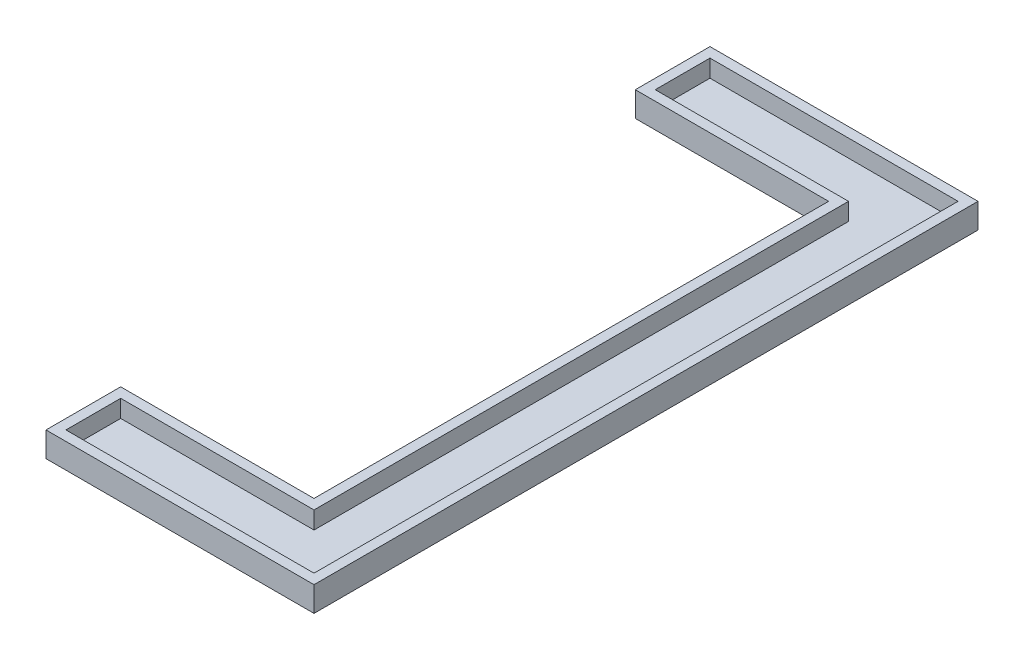
ISO-10303-21;
HEADER;
FILE_DESCRIPTION(('STEP AP214'),'2;1');
FILE_NAME('part.step','',(''),(''),'','','');
FILE_SCHEMA(('AUTOMOTIVE_DESIGN { 1 0 10303 214 1 1 1 1 }'));
ENDSEC;
DATA;
#1=APPLICATION_CONTEXT('core data for automotive mechanical design processes');
#2=APPLICATION_PROTOCOL_DEFINITION('international standard','automotive_design',2000,#1);
#3=PRODUCT_CONTEXT('',#1,'mechanical');
#4=PRODUCT('Part','Part','',(#3));
#5=PRODUCT_RELATED_PRODUCT_CATEGORY('part','',(#4));
#6=PRODUCT_DEFINITION_FORMATION('','',#4);
#7=PRODUCT_DEFINITION_CONTEXT('part definition',#1,'design');
#8=PRODUCT_DEFINITION('design','',#6,#7);
#9=PRODUCT_DEFINITION_SHAPE('','',#8);
#10=(LENGTH_UNIT() NAMED_UNIT(*) SI_UNIT(.MILLI.,.METRE.));
#11=(NAMED_UNIT(*) PLANE_ANGLE_UNIT() SI_UNIT($,.RADIAN.));
#12=(NAMED_UNIT(*) SI_UNIT($,.STERADIAN.) SOLID_ANGLE_UNIT());
#13=UNCERTAINTY_MEASURE_WITH_UNIT(LENGTH_MEASURE(1.E-05),#10,'distance_accuracy_value','');
#14=(GEOMETRIC_REPRESENTATION_CONTEXT(3) GLOBAL_UNCERTAINTY_ASSIGNED_CONTEXT((#13)) GLOBAL_UNIT_ASSIGNED_CONTEXT((#10,
#11,#12)) REPRESENTATION_CONTEXT('',''));
#15=CARTESIAN_POINT('',(0.,0.,0.));
#16=DIRECTION('',(0.,0.,1.));
#17=DIRECTION('',(1.,0.,0.));
#18=AXIS2_PLACEMENT_3D('',#15,#16,#17);
#19=CARTESIAN_POINT('',(0.,4.,-106.68));
#20=DIRECTION('',(1.,0.,0.));
#21=DIRECTION('',(0.,0.,-1.));
#22=AXIS2_PLACEMENT_3D('',#19,#20,#21);
#23=PLANE('',#22);
#24=DIRECTION('',(0.,0.,1.));
#25=VECTOR('',#24,1.);
#26=CARTESIAN_POINT('',(0.,0.,-106.68));
#27=LINE('',#26,#25);
#28=CARTESIAN_POINT('',(0.,0.,-106.68));
#29=VERTEX_POINT('',#28);
#30=CARTESIAN_POINT('',(0.,0.,-94.6800000000001));
#31=VERTEX_POINT('',#30);
#32=EDGE_CURVE('E142',#29,#31,#27,.T.);
#33=ORIENTED_EDGE('',*,*,#32,.T.);
#34=DIRECTION('',(0.,-1.,0.));
#35=VECTOR('',#34,1.);
#36=CARTESIAN_POINT('',(0.,4.,-94.6800000000001));
#37=LINE('',#36,#35);
#38=CARTESIAN_POINT('',(0.,4.,-94.6800000000001));
#39=VERTEX_POINT('',#38);
#40=EDGE_CURVE('E11',#39,#31,#37,.T.);
#41=ORIENTED_EDGE('',*,*,#40,.F.);
#42=DIRECTION('',(0.,0.,1.));
#43=VECTOR('',#42,1.);
#44=CARTESIAN_POINT('',(0.,4.,-106.68));
#45=LINE('',#44,#43);
#46=CARTESIAN_POINT('',(0.,4.,-106.68));
#47=VERTEX_POINT('',#46);
#48=EDGE_CURVE('E158',#47,#39,#45,.T.);
#49=ORIENTED_EDGE('',*,*,#48,.F.);
#50=DIRECTION('',(0.,-1.,0.));
#51=VECTOR('',#50,1.);
#52=CARTESIAN_POINT('',(0.,4.,-106.68));
#53=LINE('',#52,#51);
#54=EDGE_CURVE('E138',#47,#29,#53,.T.);
#55=ORIENTED_EDGE('',*,*,#54,.T.);
#56=EDGE_LOOP('',(#33,#41,#49,#55));
#57=FACE_BOUND('',#56,.T.);
#58=ADVANCED_FACE('F34',(#57),#23,.F.);
#59=CARTESIAN_POINT('',(0.,4.,-94.6800000000001));
#60=DIRECTION('',(0.,0.,-1.));
#61=DIRECTION('',(-1.,0.,0.));
#62=AXIS2_PLACEMENT_3D('',#59,#60,#61);
#63=PLANE('',#62);
#64=DIRECTION('',(1.,0.,0.));
#65=VECTOR('',#64,1.);
#66=CARTESIAN_POINT('',(0.,0.,-94.6800000000001));
#67=LINE('',#66,#65);
#68=CARTESIAN_POINT('',(31.06,0.,-94.6800000000001));
#69=VERTEX_POINT('',#68);
#70=EDGE_CURVE('E145',#31,#69,#67,.T.);
#71=ORIENTED_EDGE('',*,*,#70,.T.);
#72=DIRECTION('',(0.,-1.,0.));
#73=VECTOR('',#72,1.);
#74=CARTESIAN_POINT('',(31.06,4.,-94.6800000000001));
#75=LINE('',#74,#73);
#76=CARTESIAN_POINT('',(31.06,4.,-94.6800000000001));
#77=VERTEX_POINT('',#76);
#78=EDGE_CURVE('E41',#77,#69,#75,.T.);
#79=ORIENTED_EDGE('',*,*,#78,.F.);
#80=DIRECTION('',(1.,0.,0.));
#81=VECTOR('',#80,1.);
#82=CARTESIAN_POINT('',(0.,4.,-94.6800000000001));
#83=LINE('',#82,#81);
#84=EDGE_CURVE('E98',#39,#77,#83,.T.);
#85=ORIENTED_EDGE('',*,*,#84,.F.);
#86=ORIENTED_EDGE('',*,*,#40,.T.);
#87=EDGE_LOOP('',(#71,#79,#85,#86));
#88=FACE_BOUND('',#87,.T.);
#89=ADVANCED_FACE('F332',(#88),#63,.F.);
#90=CARTESIAN_POINT('',(31.06,4.,-94.6800000000001));
#91=DIRECTION('',(1.,0.,0.));
#92=DIRECTION('',(0.,0.,-1.));
#93=AXIS2_PLACEMENT_3D('',#90,#91,#92);
#94=PLANE('',#93);
#95=DIRECTION('',(0.,0.,1.));
#96=VECTOR('',#95,1.);
#97=CARTESIAN_POINT('',(31.06,0.,-94.6800000000001));
#98=LINE('',#97,#96);
#99=CARTESIAN_POINT('',(31.06,0.,-12.));
#100=VERTEX_POINT('',#99);
#101=EDGE_CURVE('E148',#69,#100,#98,.T.);
#102=ORIENTED_EDGE('',*,*,#101,.T.);
#103=DIRECTION('',(0.,-1.,0.));
#104=VECTOR('',#103,1.);
#105=CARTESIAN_POINT('',(31.06,4.,-12.));
#106=LINE('',#105,#104);
#107=CARTESIAN_POINT('',(31.06,4.,-12.));
#108=VERTEX_POINT('',#107);
#109=EDGE_CURVE('E165',#108,#100,#106,.T.);
#110=ORIENTED_EDGE('',*,*,#109,.F.);
#111=DIRECTION('',(0.,0.,1.));
#112=VECTOR('',#111,1.);
#113=CARTESIAN_POINT('',(31.06,4.,-94.6800000000001));
#114=LINE('',#113,#112);
#115=EDGE_CURVE('E173',#77,#108,#114,.T.);
#116=ORIENTED_EDGE('',*,*,#115,.F.);
#117=ORIENTED_EDGE('',*,*,#78,.T.);
#118=EDGE_LOOP('',(#102,#110,#116,#117));
#119=FACE_BOUND('',#118,.T.);
#120=ADVANCED_FACE('F171',(#119),#94,.F.);
#121=CARTESIAN_POINT('',(31.06,4.,-12.));
#122=DIRECTION('',(0.,0.,1.));
#123=DIRECTION('',(1.,0.,0.));
#124=AXIS2_PLACEMENT_3D('',#121,#122,#123);
#125=PLANE('',#124);
#126=DIRECTION('',(-1.,0.,0.));
#127=VECTOR('',#126,1.);
#128=CARTESIAN_POINT('',(31.06,0.,-12.));
#129=LINE('',#128,#127);
#130=CARTESIAN_POINT('',(0.,0.,-12.));
#131=VERTEX_POINT('',#130);
#132=EDGE_CURVE('E150',#100,#131,#129,.T.);
#133=ORIENTED_EDGE('',*,*,#132,.T.);
#134=DIRECTION('',(0.,-1.,0.));
#135=VECTOR('',#134,1.);
#136=CARTESIAN_POINT('',(0.,4.,-12.));
#137=LINE('',#136,#135);
#138=CARTESIAN_POINT('',(0.,4.,-12.));
#139=VERTEX_POINT('',#138);
#140=EDGE_CURVE('E162',#139,#131,#137,.T.);
#141=ORIENTED_EDGE('',*,*,#140,.F.);
#142=DIRECTION('',(-1.,0.,0.));
#143=VECTOR('',#142,1.);
#144=CARTESIAN_POINT('',(31.06,4.,-12.));
#145=LINE('',#144,#143);
#146=EDGE_CURVE('E185',#108,#139,#145,.T.);
#147=ORIENTED_EDGE('',*,*,#146,.F.);
#148=ORIENTED_EDGE('',*,*,#109,.T.);
#149=EDGE_LOOP('',(#133,#141,#147,#148));
#150=FACE_BOUND('',#149,.T.);
#151=ADVANCED_FACE('F181',(#150),#125,.F.);
#152=CARTESIAN_POINT('',(0.,4.,0.));
#153=DIRECTION('',(1.,0.,0.));
#154=DIRECTION('',(0.,0.,-1.));
#155=AXIS2_PLACEMENT_3D('',#152,#153,#154);
#156=PLANE('',#155);
#157=DIRECTION('',(0.,0.,1.));
#158=VECTOR('',#157,1.);
#159=CARTESIAN_POINT('',(0.,0.,0.));
#160=LINE('',#159,#158);
#161=CARTESIAN_POINT('',(0.,0.,0.));
#162=VERTEX_POINT('',#161);
#163=EDGE_CURVE('E152',#131,#162,#160,.T.);
#164=ORIENTED_EDGE('',*,*,#163,.T.);
#165=DIRECTION('',(0.,-1.,0.));
#166=VECTOR('',#165,1.);
#167=CARTESIAN_POINT('',(0.,4.,0.));
#168=LINE('',#167,#166);
#169=CARTESIAN_POINT('',(0.,4.,0.));
#170=VERTEX_POINT('',#169);
#171=EDGE_CURVE('E133',#170,#162,#168,.T.);
#172=ORIENTED_EDGE('',*,*,#171,.F.);
#173=DIRECTION('',(0.,0.,1.));
#174=VECTOR('',#173,1.);
#175=CARTESIAN_POINT('',(0.,4.,0.));
#176=LINE('',#175,#174);
#177=EDGE_CURVE('E121',#139,#170,#176,.T.);
#178=ORIENTED_EDGE('',*,*,#177,.F.);
#179=ORIENTED_EDGE('',*,*,#140,.T.);
#180=EDGE_LOOP('',(#164,#172,#178,#179));
#181=FACE_BOUND('',#180,.T.);
#182=ADVANCED_FACE('F184',(#181),#156,.F.);
#183=CARTESIAN_POINT('',(43.06,4.,0.));
#184=DIRECTION('',(0.,0.,-1.));
#185=DIRECTION('',(-1.,0.,0.));
#186=AXIS2_PLACEMENT_3D('',#183,#184,#185);
#187=PLANE('',#186);
#188=DIRECTION('',(1.,0.,0.));
#189=VECTOR('',#188,1.);
#190=CARTESIAN_POINT('',(43.06,0.,0.));
#191=LINE('',#190,#189);
#192=CARTESIAN_POINT('',(43.06,0.,0.));
#193=VERTEX_POINT('',#192);
#194=EDGE_CURVE('E130',#162,#193,#191,.T.);
#195=ORIENTED_EDGE('',*,*,#194,.T.);
#196=DIRECTION('',(0.,-1.,0.));
#197=VECTOR('',#196,1.);
#198=CARTESIAN_POINT('',(43.06,4.,0.));
#199=LINE('',#198,#197);
#200=CARTESIAN_POINT('',(43.06,4.,0.));
#201=VERTEX_POINT('',#200);
#202=EDGE_CURVE('E127',#201,#193,#199,.T.);
#203=ORIENTED_EDGE('',*,*,#202,.F.);
#204=DIRECTION('',(1.,0.,0.));
#205=VECTOR('',#204,1.);
#206=CARTESIAN_POINT('',(43.06,4.,0.));
#207=LINE('',#206,#205);
#208=EDGE_CURVE('E114',#170,#201,#207,.T.);
#209=ORIENTED_EDGE('',*,*,#208,.F.);
#210=ORIENTED_EDGE('',*,*,#171,.T.);
#211=EDGE_LOOP('',(#195,#203,#209,#210));
#212=FACE_BOUND('',#211,.T.);
#213=ADVANCED_FACE('F128',(#212),#187,.F.);
#214=CARTESIAN_POINT('',(43.06,4.,-106.68));
#215=DIRECTION('',(-1.,0.,0.));
#216=DIRECTION('',(0.,0.,1.));
#217=AXIS2_PLACEMENT_3D('',#214,#215,#216);
#218=PLANE('',#217);
#219=DIRECTION('',(0.,0.,-1.));
#220=VECTOR('',#219,1.);
#221=CARTESIAN_POINT('',(43.06,0.,-106.68));
#222=LINE('',#221,#220);
#223=CARTESIAN_POINT('',(43.06,0.,-106.68));
#224=VERTEX_POINT('',#223);
#225=EDGE_CURVE('E155',#193,#224,#222,.T.);
#226=ORIENTED_EDGE('',*,*,#225,.T.);
#227=DIRECTION('',(0.,-1.,0.));
#228=VECTOR('',#227,1.);
#229=CARTESIAN_POINT('',(43.06,4.,-106.68));
#230=LINE('',#229,#228);
#231=CARTESIAN_POINT('',(43.06,4.,-106.68));
#232=VERTEX_POINT('',#231);
#233=EDGE_CURVE('E134',#232,#224,#230,.T.);
#234=ORIENTED_EDGE('',*,*,#233,.F.);
#235=DIRECTION('',(0.,0.,-1.));
#236=VECTOR('',#235,1.);
#237=CARTESIAN_POINT('',(43.06,4.,-106.68));
#238=LINE('',#237,#236);
#239=EDGE_CURVE('E118',#201,#232,#238,.T.);
#240=ORIENTED_EDGE('',*,*,#239,.F.);
#241=ORIENTED_EDGE('',*,*,#202,.T.);
#242=EDGE_LOOP('',(#226,#234,#240,#241));
#243=FACE_BOUND('',#242,.T.);
#244=ADVANCED_FACE('F136',(#243),#218,.F.);
#245=CARTESIAN_POINT('',(0.,4.,-106.68));
#246=DIRECTION('',(0.,0.,1.));
#247=DIRECTION('',(1.,0.,0.));
#248=AXIS2_PLACEMENT_3D('',#245,#246,#247);
#249=PLANE('',#248);
#250=DIRECTION('',(-1.,0.,0.));
#251=VECTOR('',#250,1.);
#252=CARTESIAN_POINT('',(0.,0.,-106.68));
#253=LINE('',#252,#251);
#254=EDGE_CURVE('E90',#224,#29,#253,.T.);
#255=ORIENTED_EDGE('',*,*,#254,.T.);
#256=ORIENTED_EDGE('',*,*,#54,.F.);
#257=DIRECTION('',(-1.,0.,0.));
#258=VECTOR('',#257,1.);
#259=CARTESIAN_POINT('',(0.,4.,-106.68));
#260=LINE('',#259,#258);
#261=EDGE_CURVE('E57',#232,#47,#260,.T.);
#262=ORIENTED_EDGE('',*,*,#261,.F.);
#263=ORIENTED_EDGE('',*,*,#233,.T.);
#264=EDGE_LOOP('',(#255,#256,#262,#263));
#265=FACE_BOUND('',#264,.T.);
#266=ADVANCED_FACE('F339',(#265),#249,.F.);
#267=CARTESIAN_POINT('',(0.,4.,0.));
#268=DIRECTION('',(0.,1.,0.));
#269=DIRECTION('',(0.,0.,1.));
#270=AXIS2_PLACEMENT_3D('',#267,#268,#269);
#271=PLANE('',#270);
#272=DIRECTION('',(-1.,0.,0.));
#273=VECTOR('',#272,1.);
#274=CARTESIAN_POINT('',(41.46,4.,-105.08));
#275=LINE('',#274,#273);
#276=CARTESIAN_POINT('',(41.46,4.,-105.08));
#277=VERTEX_POINT('',#276);
#278=CARTESIAN_POINT('',(1.59999999999999,4.,-105.08));
#279=VERTEX_POINT('',#278);
#280=EDGE_CURVE('E48',#277,#279,#275,.T.);
#281=ORIENTED_EDGE('',*,*,#280,.F.);
#282=DIRECTION('',(0.,0.,-1.));
#283=VECTOR('',#282,1.);
#284=CARTESIAN_POINT('',(41.46,4.,-1.6));
#285=LINE('',#284,#283);
#286=CARTESIAN_POINT('',(41.46,4.,-1.6));
#287=VERTEX_POINT('',#286);
#288=EDGE_CURVE('E213',#287,#277,#285,.T.);
#289=ORIENTED_EDGE('',*,*,#288,.F.);
#290=DIRECTION('',(1.,0.,0.));
#291=VECTOR('',#290,1.);
#292=CARTESIAN_POINT('',(1.6,4.,-1.6));
#293=LINE('',#292,#291);
#294=CARTESIAN_POINT('',(1.6,4.,-1.6));
#295=VERTEX_POINT('',#294);
#296=EDGE_CURVE('E217',#295,#287,#293,.T.);
#297=ORIENTED_EDGE('',*,*,#296,.F.);
#298=DIRECTION('',(0.,0.,1.));
#299=VECTOR('',#298,1.);
#300=CARTESIAN_POINT('',(1.6,4.,-10.4));
#301=LINE('',#300,#299);
#302=CARTESIAN_POINT('',(1.6,4.,-10.4));
#303=VERTEX_POINT('',#302);
#304=EDGE_CURVE('E220',#303,#295,#301,.T.);
#305=ORIENTED_EDGE('',*,*,#304,.F.);
#306=DIRECTION('',(-1.,0.,0.));
#307=VECTOR('',#306,1.);
#308=CARTESIAN_POINT('',(32.66,4.,-10.4));
#309=LINE('',#308,#307);
#310=CARTESIAN_POINT('',(32.66,4.,-10.4));
#311=VERTEX_POINT('',#310);
#312=EDGE_CURVE('E223',#311,#303,#309,.T.);
#313=ORIENTED_EDGE('',*,*,#312,.F.);
#314=DIRECTION('',(0.,0.,1.));
#315=VECTOR('',#314,1.);
#316=CARTESIAN_POINT('',(32.66,4.,-96.2800000000001));
#317=LINE('',#316,#315);
#318=CARTESIAN_POINT('',(32.66,4.,-96.2800000000001));
#319=VERTEX_POINT('',#318);
#320=EDGE_CURVE('E226',#319,#311,#317,.T.);
#321=ORIENTED_EDGE('',*,*,#320,.F.);
#322=DIRECTION('',(1.,0.,0.));
#323=VECTOR('',#322,1.);
#324=CARTESIAN_POINT('',(1.59999999999999,4.,-96.2800000000001));
#325=LINE('',#324,#323);
#326=CARTESIAN_POINT('',(1.59999999999999,4.,-96.2800000000001));
#327=VERTEX_POINT('',#326);
#328=EDGE_CURVE('E229',#327,#319,#325,.T.);
#329=ORIENTED_EDGE('',*,*,#328,.F.);
#330=DIRECTION('',(0.,0.,1.));
#331=VECTOR('',#330,1.);
#332=CARTESIAN_POINT('',(1.59999999999999,4.,-105.08));
#333=LINE('',#332,#331);
#334=EDGE_CURVE('E232',#279,#327,#333,.T.);
#335=ORIENTED_EDGE('',*,*,#334,.F.);
#336=EDGE_LOOP('',(#281,#289,#297,#305,#313,#321,#329,#335));
#337=FACE_BOUND('',#336,.T.);
#338=ORIENTED_EDGE('',*,*,#48,.T.);
#339=ORIENTED_EDGE('',*,*,#84,.T.);
#340=ORIENTED_EDGE('',*,*,#115,.T.);
#341=ORIENTED_EDGE('',*,*,#146,.T.);
#342=ORIENTED_EDGE('',*,*,#177,.T.);
#343=ORIENTED_EDGE('',*,*,#208,.T.);
#344=ORIENTED_EDGE('',*,*,#239,.T.);
#345=ORIENTED_EDGE('',*,*,#261,.T.);
#346=EDGE_LOOP('',(#338,#339,#340,#341,#342,#343,#344,#345));
#347=FACE_BOUND('',#346,.T.);
#348=ADVANCED_FACE('F116',(#337,#347),#271,.T.);
#349=CARTESIAN_POINT('',(0.,0.,0.));
#350=DIRECTION('',(0.,1.,0.));
#351=DIRECTION('',(0.,0.,1.));
#352=AXIS2_PLACEMENT_3D('',#349,#350,#351);
#353=PLANE('',#352);
#354=ORIENTED_EDGE('',*,*,#32,.F.);
#355=ORIENTED_EDGE('',*,*,#254,.F.);
#356=ORIENTED_EDGE('',*,*,#225,.F.);
#357=ORIENTED_EDGE('',*,*,#194,.F.);
#358=ORIENTED_EDGE('',*,*,#163,.F.);
#359=ORIENTED_EDGE('',*,*,#132,.F.);
#360=ORIENTED_EDGE('',*,*,#101,.F.);
#361=ORIENTED_EDGE('',*,*,#70,.F.);
#362=EDGE_LOOP('',(#354,#355,#356,#357,#358,#359,#360,#361));
#363=FACE_BOUND('',#362,.T.);
#364=ADVANCED_FACE('F177',(#363),#353,.F.);
#365=CARTESIAN_POINT('',(41.46,1.2,-105.08));
#366=DIRECTION('',(0.,0.,-1.));
#367=DIRECTION('',(-1.,0.,0.));
#368=AXIS2_PLACEMENT_3D('',#365,#366,#367);
#369=PLANE('',#368);
#370=ORIENTED_EDGE('',*,*,#280,.T.);
#371=DIRECTION('',(0.,1.,0.));
#372=VECTOR('',#371,1.);
#373=CARTESIAN_POINT('',(1.59999999999999,1.2,-105.08));
#374=LINE('',#373,#372);
#375=CARTESIAN_POINT('',(1.59999999999999,1.2,-105.08));
#376=VERTEX_POINT('',#375);
#377=EDGE_CURVE('E191',#376,#279,#374,.T.);
#378=ORIENTED_EDGE('',*,*,#377,.F.);
#379=DIRECTION('',(-1.,0.,0.));
#380=VECTOR('',#379,1.);
#381=CARTESIAN_POINT('',(41.46,1.2,-105.08));
#382=LINE('',#381,#380);
#383=CARTESIAN_POINT('',(41.46,1.2,-105.08));
#384=VERTEX_POINT('',#383);
#385=EDGE_CURVE('E216',#384,#376,#382,.T.);
#386=ORIENTED_EDGE('',*,*,#385,.F.);
#387=DIRECTION('',(0.,1.,0.));
#388=VECTOR('',#387,1.);
#389=CARTESIAN_POINT('',(41.46,1.2,-105.08));
#390=LINE('',#389,#388);
#391=EDGE_CURVE('E146',#384,#277,#390,.T.);
#392=ORIENTED_EDGE('',*,*,#391,.T.);
#393=EDGE_LOOP('',(#370,#378,#386,#392));
#394=FACE_BOUND('',#393,.T.);
#395=ADVANCED_FACE('F265',(#394),#369,.F.);
#396=CARTESIAN_POINT('',(41.46,1.2,-1.6));
#397=DIRECTION('',(1.,0.,0.));
#398=DIRECTION('',(0.,0.,-1.));
#399=AXIS2_PLACEMENT_3D('',#396,#397,#398);
#400=PLANE('',#399);
#401=ORIENTED_EDGE('',*,*,#288,.T.);
#402=ORIENTED_EDGE('',*,*,#391,.F.);
#403=DIRECTION('',(0.,0.,-1.));
#404=VECTOR('',#403,1.);
#405=CARTESIAN_POINT('',(41.46,1.2,-1.6));
#406=LINE('',#405,#404);
#407=CARTESIAN_POINT('',(41.46,1.2,-1.6));
#408=VERTEX_POINT('',#407);
#409=EDGE_CURVE('E194',#408,#384,#406,.T.);
#410=ORIENTED_EDGE('',*,*,#409,.F.);
#411=DIRECTION('',(0.,1.,0.));
#412=VECTOR('',#411,1.);
#413=CARTESIAN_POINT('',(41.46,1.2,-1.6));
#414=LINE('',#413,#412);
#415=EDGE_CURVE('E209',#408,#287,#414,.T.);
#416=ORIENTED_EDGE('',*,*,#415,.T.);
#417=EDGE_LOOP('',(#401,#402,#410,#416));
#418=FACE_BOUND('',#417,.T.);
#419=ADVANCED_FACE('F285',(#418),#400,.F.);
#420=CARTESIAN_POINT('',(1.6,1.2,-1.6));
#421=DIRECTION('',(0.,0.,1.));
#422=DIRECTION('',(1.,0.,0.));
#423=AXIS2_PLACEMENT_3D('',#420,#421,#422);
#424=PLANE('',#423);
#425=ORIENTED_EDGE('',*,*,#296,.T.);
#426=ORIENTED_EDGE('',*,*,#415,.F.);
#427=DIRECTION('',(1.,0.,0.));
#428=VECTOR('',#427,1.);
#429=CARTESIAN_POINT('',(1.6,1.2,-1.6));
#430=LINE('',#429,#428);
#431=CARTESIAN_POINT('',(1.6,1.2,-1.6));
#432=VERTEX_POINT('',#431);
#433=EDGE_CURVE('E238',#432,#408,#430,.T.);
#434=ORIENTED_EDGE('',*,*,#433,.F.);
#435=DIRECTION('',(0.,1.,0.));
#436=VECTOR('',#435,1.);
#437=CARTESIAN_POINT('',(1.6,1.2,-1.6));
#438=LINE('',#437,#436);
#439=EDGE_CURVE('E206',#432,#295,#438,.T.);
#440=ORIENTED_EDGE('',*,*,#439,.T.);
#441=EDGE_LOOP('',(#425,#426,#434,#440));
#442=FACE_BOUND('',#441,.T.);
#443=ADVANCED_FACE('F290',(#442),#424,.F.);
#444=CARTESIAN_POINT('',(1.6,1.2,-10.4));
#445=DIRECTION('',(-1.,0.,0.));
#446=DIRECTION('',(0.,0.,1.));
#447=AXIS2_PLACEMENT_3D('',#444,#445,#446);
#448=PLANE('',#447);
#449=ORIENTED_EDGE('',*,*,#304,.T.);
#450=ORIENTED_EDGE('',*,*,#439,.F.);
#451=DIRECTION('',(0.,0.,1.));
#452=VECTOR('',#451,1.);
#453=CARTESIAN_POINT('',(1.6,1.2,-10.4));
#454=LINE('',#453,#452);
#455=CARTESIAN_POINT('',(1.6,1.2,-10.4));
#456=VERTEX_POINT('',#455);
#457=EDGE_CURVE('E241',#456,#432,#454,.T.);
#458=ORIENTED_EDGE('',*,*,#457,.F.);
#459=DIRECTION('',(0.,1.,0.));
#460=VECTOR('',#459,1.);
#461=CARTESIAN_POINT('',(1.6,1.2,-10.4));
#462=LINE('',#461,#460);
#463=EDGE_CURVE('E203',#456,#303,#462,.T.);
#464=ORIENTED_EDGE('',*,*,#463,.T.);
#465=EDGE_LOOP('',(#449,#450,#458,#464));
#466=FACE_BOUND('',#465,.T.);
#467=ADVANCED_FACE('F316',(#466),#448,.F.);
#468=CARTESIAN_POINT('',(32.66,1.2,-10.4));
#469=DIRECTION('',(0.,0.,-1.));
#470=DIRECTION('',(-1.,0.,0.));
#471=AXIS2_PLACEMENT_3D('',#468,#469,#470);
#472=PLANE('',#471);
#473=ORIENTED_EDGE('',*,*,#312,.T.);
#474=ORIENTED_EDGE('',*,*,#463,.F.);
#475=DIRECTION('',(-1.,0.,0.));
#476=VECTOR('',#475,1.);
#477=CARTESIAN_POINT('',(32.66,1.2,-10.4));
#478=LINE('',#477,#476);
#479=CARTESIAN_POINT('',(32.66,1.2,-10.4));
#480=VERTEX_POINT('',#479);
#481=EDGE_CURVE('E244',#480,#456,#478,.T.);
#482=ORIENTED_EDGE('',*,*,#481,.F.);
#483=DIRECTION('',(0.,1.,0.));
#484=VECTOR('',#483,1.);
#485=CARTESIAN_POINT('',(32.66,1.2,-10.4));
#486=LINE('',#485,#484);
#487=EDGE_CURVE('E200',#480,#311,#486,.T.);
#488=ORIENTED_EDGE('',*,*,#487,.T.);
#489=EDGE_LOOP('',(#473,#474,#482,#488));
#490=FACE_BOUND('',#489,.T.);
#491=ADVANCED_FACE('F319',(#490),#472,.F.);
#492=CARTESIAN_POINT('',(32.66,1.2,-96.2800000000001));
#493=DIRECTION('',(-1.,0.,0.));
#494=DIRECTION('',(0.,0.,1.));
#495=AXIS2_PLACEMENT_3D('',#492,#493,#494);
#496=PLANE('',#495);
#497=ORIENTED_EDGE('',*,*,#320,.T.);
#498=ORIENTED_EDGE('',*,*,#487,.F.);
#499=DIRECTION('',(0.,0.,1.));
#500=VECTOR('',#499,1.);
#501=CARTESIAN_POINT('',(32.66,1.2,-96.2800000000001));
#502=LINE('',#501,#500);
#503=CARTESIAN_POINT('',(32.66,1.2,-96.2800000000001));
#504=VERTEX_POINT('',#503);
#505=EDGE_CURVE('E247',#504,#480,#502,.T.);
#506=ORIENTED_EDGE('',*,*,#505,.F.);
#507=DIRECTION('',(0.,1.,0.));
#508=VECTOR('',#507,1.);
#509=CARTESIAN_POINT('',(32.66,1.2,-96.2800000000001));
#510=LINE('',#509,#508);
#511=EDGE_CURVE('E197',#504,#319,#510,.T.);
#512=ORIENTED_EDGE('',*,*,#511,.T.);
#513=EDGE_LOOP('',(#497,#498,#506,#512));
#514=FACE_BOUND('',#513,.T.);
#515=ADVANCED_FACE('F322',(#514),#496,.F.);
#516=CARTESIAN_POINT('',(1.59999999999999,1.2,-96.2800000000001));
#517=DIRECTION('',(0.,0.,1.));
#518=DIRECTION('',(1.,0.,0.));
#519=AXIS2_PLACEMENT_3D('',#516,#517,#518);
#520=PLANE('',#519);
#521=ORIENTED_EDGE('',*,*,#328,.T.);
#522=ORIENTED_EDGE('',*,*,#511,.F.);
#523=DIRECTION('',(1.,0.,0.));
#524=VECTOR('',#523,1.);
#525=CARTESIAN_POINT('',(1.59999999999999,1.2,-96.2800000000001));
#526=LINE('',#525,#524);
#527=CARTESIAN_POINT('',(1.59999999999999,1.2,-96.2800000000001));
#528=VERTEX_POINT('',#527);
#529=EDGE_CURVE('E250',#528,#504,#526,.T.);
#530=ORIENTED_EDGE('',*,*,#529,.F.);
#531=DIRECTION('',(0.,1.,0.));
#532=VECTOR('',#531,1.);
#533=CARTESIAN_POINT('',(1.59999999999999,1.2,-96.2800000000001));
#534=LINE('',#533,#532);
#535=EDGE_CURVE('E193',#528,#327,#534,.T.);
#536=ORIENTED_EDGE('',*,*,#535,.T.);
#537=EDGE_LOOP('',(#521,#522,#530,#536));
#538=FACE_BOUND('',#537,.T.);
#539=ADVANCED_FACE('F305',(#538),#520,.F.);
#540=CARTESIAN_POINT('',(1.59999999999999,1.2,-105.08));
#541=DIRECTION('',(-1.,0.,0.));
#542=DIRECTION('',(0.,0.,1.));
#543=AXIS2_PLACEMENT_3D('',#540,#541,#542);
#544=PLANE('',#543);
#545=ORIENTED_EDGE('',*,*,#334,.T.);
#546=ORIENTED_EDGE('',*,*,#535,.F.);
#547=DIRECTION('',(0.,0.,1.));
#548=VECTOR('',#547,1.);
#549=CARTESIAN_POINT('',(1.59999999999999,1.2,-105.08));
#550=LINE('',#549,#548);
#551=EDGE_CURVE('E253',#376,#528,#550,.T.);
#552=ORIENTED_EDGE('',*,*,#551,.F.);
#553=ORIENTED_EDGE('',*,*,#377,.T.);
#554=EDGE_LOOP('',(#545,#546,#552,#553));
#555=FACE_BOUND('',#554,.T.);
#556=ADVANCED_FACE('F299',(#555),#544,.F.);
#557=CARTESIAN_POINT('',(0.,1.2,0.));
#558=DIRECTION('',(0.,1.,0.));
#559=DIRECTION('',(0.,0.,1.));
#560=AXIS2_PLACEMENT_3D('',#557,#558,#559);
#561=PLANE('',#560);
#562=ORIENTED_EDGE('',*,*,#385,.T.);
#563=ORIENTED_EDGE('',*,*,#551,.T.);
#564=ORIENTED_EDGE('',*,*,#529,.T.);
#565=ORIENTED_EDGE('',*,*,#505,.T.);
#566=ORIENTED_EDGE('',*,*,#481,.T.);
#567=ORIENTED_EDGE('',*,*,#457,.T.);
#568=ORIENTED_EDGE('',*,*,#433,.T.);
#569=ORIENTED_EDGE('',*,*,#409,.T.);
#570=EDGE_LOOP('',(#562,#563,#564,#565,#566,#567,#568,#569));
#571=FACE_BOUND('',#570,.T.);
#572=ADVANCED_FACE('F260',(#571),#561,.T.);
#573=CLOSED_SHELL('',(#58,#89,#120,#151,#182,#213,#244,#266,#348,#364,#395,#419,#443,#467,#491,
#515,#539,#556,#572));
#574=MANIFOLD_SOLID_BREP('B2',#573);
#575=ADVANCED_BREP_SHAPE_REPRESENTATION('',(#18,#574),#14);
#576=SHAPE_DEFINITION_REPRESENTATION(#9,#575);
ENDSEC;
END-ISO-10303-21;
